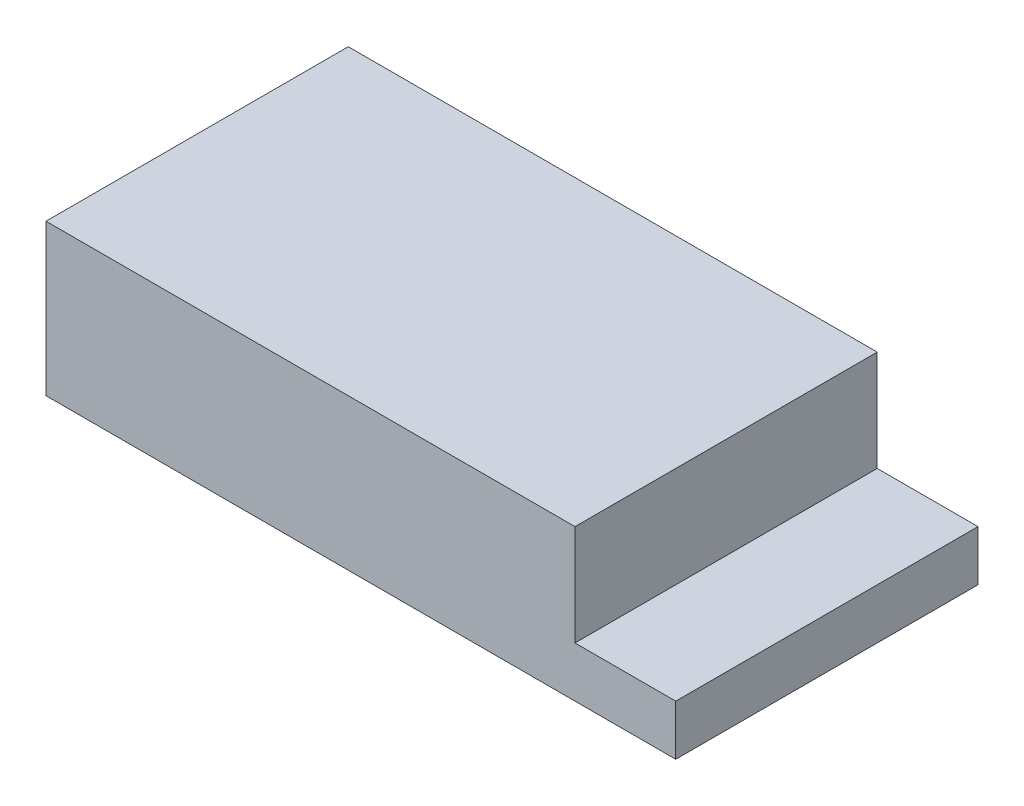
ISO-10303-21;
HEADER;
FILE_DESCRIPTION(('STEP AP214'),'2;1');
FILE_NAME('part.step','',(''),(''),'','','');
FILE_SCHEMA(('AUTOMOTIVE_DESIGN { 1 0 10303 214 1 1 1 1 }'));
ENDSEC;
DATA;
#1=APPLICATION_CONTEXT('core data for automotive mechanical design processes');
#2=APPLICATION_PROTOCOL_DEFINITION('international standard','automotive_design',2000,#1);
#3=PRODUCT_CONTEXT('',#1,'mechanical');
#4=PRODUCT('Part','Part','',(#3));
#5=PRODUCT_RELATED_PRODUCT_CATEGORY('part','',(#4));
#6=PRODUCT_DEFINITION_FORMATION('','',#4);
#7=PRODUCT_DEFINITION_CONTEXT('part definition',#1,'design');
#8=PRODUCT_DEFINITION('design','',#6,#7);
#9=PRODUCT_DEFINITION_SHAPE('','',#8);
#10=(LENGTH_UNIT() NAMED_UNIT(*) SI_UNIT(.MILLI.,.METRE.));
#11=(NAMED_UNIT(*) PLANE_ANGLE_UNIT() SI_UNIT($,.RADIAN.));
#12=(NAMED_UNIT(*) SI_UNIT($,.STERADIAN.) SOLID_ANGLE_UNIT());
#13=UNCERTAINTY_MEASURE_WITH_UNIT(LENGTH_MEASURE(1.E-05),#10,'distance_accuracy_value','');
#14=(GEOMETRIC_REPRESENTATION_CONTEXT(3) GLOBAL_UNCERTAINTY_ASSIGNED_CONTEXT((#13)) GLOBAL_UNIT_ASSIGNED_CONTEXT((#10,
#11,#12)) REPRESENTATION_CONTEXT('',''));
#15=CARTESIAN_POINT('',(0.,0.,0.));
#16=DIRECTION('',(0.,0.,1.));
#17=DIRECTION('',(1.,0.,0.));
#18=AXIS2_PLACEMENT_3D('',#15,#16,#17);
#19=CARTESIAN_POINT('',(125.,30.,0.));
#20=DIRECTION('',(-1.,0.,0.));
#21=DIRECTION('',(0.,0.,1.));
#22=AXIS2_PLACEMENT_3D('',#19,#20,#21);
#23=PLANE('',#22);
#24=DIRECTION('',(0.,0.,-1.));
#25=VECTOR('',#24,1.);
#26=CARTESIAN_POINT('',(125.,10.,0.));
#27=LINE('',#26,#25);
#28=CARTESIAN_POINT('',(125.,10.,0.));
#29=VERTEX_POINT('',#28);
#30=CARTESIAN_POINT('',(125.,10.,-60.));
#31=VERTEX_POINT('',#30);
#32=EDGE_CURVE('E138',#29,#31,#27,.T.);
#33=ORIENTED_EDGE('',*,*,#32,.F.);
#34=DIRECTION('',(0.,-1.,0.));
#35=VECTOR('',#34,1.);
#36=CARTESIAN_POINT('',(125.,30.,0.));
#37=LINE('',#36,#35);
#38=CARTESIAN_POINT('',(125.,0.,0.));
#39=VERTEX_POINT('',#38);
#40=EDGE_CURVE('E60',#29,#39,#37,.T.);
#41=ORIENTED_EDGE('',*,*,#40,.T.);
#42=DIRECTION('',(0.,0.,-1.));
#43=VECTOR('',#42,1.);
#44=CARTESIAN_POINT('',(125.,0.,0.));
#45=LINE('',#44,#43);
#46=CARTESIAN_POINT('',(125.,0.,-60.));
#47=VERTEX_POINT('',#46);
#48=EDGE_CURVE('E108',#39,#47,#45,.T.);
#49=ORIENTED_EDGE('',*,*,#48,.T.);
#50=DIRECTION('',(0.,-1.,0.));
#51=VECTOR('',#50,1.);
#52=CARTESIAN_POINT('',(125.,30.,-60.));
#53=LINE('',#52,#51);
#54=EDGE_CURVE('E101',#31,#47,#53,.T.);
#55=ORIENTED_EDGE('',*,*,#54,.F.);
#56=EDGE_LOOP('',(#33,#41,#49,#55));
#57=FACE_BOUND('',#56,.T.);
#58=ADVANCED_FACE('F51',(#57),#23,.F.);
#59=CARTESIAN_POINT('',(0.,30.,0.));
#60=DIRECTION('',(1.,0.,0.));
#61=DIRECTION('',(0.,0.,-1.));
#62=AXIS2_PLACEMENT_3D('',#59,#60,#61);
#63=PLANE('',#62);
#64=DIRECTION('',(0.,0.,1.));
#65=VECTOR('',#64,1.);
#66=CARTESIAN_POINT('',(0.,0.,0.));
#67=LINE('',#66,#65);
#68=CARTESIAN_POINT('',(0.,0.,-60.));
#69=VERTEX_POINT('',#68);
#70=CARTESIAN_POINT('',(0.,0.,0.));
#71=VERTEX_POINT('',#70);
#72=EDGE_CURVE('E113',#69,#71,#67,.T.);
#73=ORIENTED_EDGE('',*,*,#72,.T.);
#74=DIRECTION('',(0.,-1.,0.));
#75=VECTOR('',#74,1.);
#76=CARTESIAN_POINT('',(0.,30.,0.));
#77=LINE('',#76,#75);
#78=CARTESIAN_POINT('',(0.,30.,0.));
#79=VERTEX_POINT('',#78);
#80=EDGE_CURVE('E11',#79,#71,#77,.T.);
#81=ORIENTED_EDGE('',*,*,#80,.F.);
#82=DIRECTION('',(0.,0.,1.));
#83=VECTOR('',#82,1.);
#84=CARTESIAN_POINT('',(0.,30.,0.));
#85=LINE('',#84,#83);
#86=CARTESIAN_POINT('',(0.,30.,-60.));
#87=VERTEX_POINT('',#86);
#88=EDGE_CURVE('E107',#87,#79,#85,.T.);
#89=ORIENTED_EDGE('',*,*,#88,.F.);
#90=DIRECTION('',(0.,-1.,0.));
#91=VECTOR('',#90,1.);
#92=CARTESIAN_POINT('',(0.,30.,-60.));
#93=LINE('',#92,#91);
#94=EDGE_CURVE('E97',#87,#69,#93,.T.);
#95=ORIENTED_EDGE('',*,*,#94,.T.);
#96=EDGE_LOOP('',(#73,#81,#89,#95));
#97=FACE_BOUND('',#96,.T.);
#98=ADVANCED_FACE('F53',(#97),#63,.F.);
#99=CARTESIAN_POINT('',(0.,30.,0.));
#100=DIRECTION('',(0.,0.,-1.));
#101=DIRECTION('',(-1.,0.,0.));
#102=AXIS2_PLACEMENT_3D('',#99,#100,#101);
#103=PLANE('',#102);
#104=DIRECTION('',(1.,0.,0.));
#105=VECTOR('',#104,1.);
#106=CARTESIAN_POINT('',(125.,10.,0.));
#107=LINE('',#106,#105);
#108=CARTESIAN_POINT('',(105.,10.,0.));
#109=VERTEX_POINT('',#108);
#110=EDGE_CURVE('E152',#109,#29,#107,.T.);
#111=ORIENTED_EDGE('',*,*,#110,.F.);
#112=DIRECTION('',(0.,1.,0.));
#113=VECTOR('',#112,1.);
#114=CARTESIAN_POINT('',(105.,10.,0.));
#115=LINE('',#114,#113);
#116=CARTESIAN_POINT('',(105.,30.,0.));
#117=VERTEX_POINT('',#116);
#118=EDGE_CURVE('E120',#109,#117,#115,.T.);
#119=ORIENTED_EDGE('',*,*,#118,.T.);
#120=DIRECTION('',(1.,0.,0.));
#121=VECTOR('',#120,1.);
#122=CARTESIAN_POINT('',(0.,30.,0.));
#123=LINE('',#122,#121);
#124=EDGE_CURVE('E143',#79,#117,#123,.T.);
#125=ORIENTED_EDGE('',*,*,#124,.F.);
#126=ORIENTED_EDGE('',*,*,#80,.T.);
#127=DIRECTION('',(1.,0.,0.));
#128=VECTOR('',#127,1.);
#129=CARTESIAN_POINT('',(0.,0.,0.));
#130=LINE('',#129,#128);
#131=EDGE_CURVE('E118',#71,#39,#130,.T.);
#132=ORIENTED_EDGE('',*,*,#131,.T.);
#133=ORIENTED_EDGE('',*,*,#40,.F.);
#134=EDGE_LOOP('',(#111,#119,#125,#126,#132,#133));
#135=FACE_BOUND('',#134,.T.);
#136=ADVANCED_FACE('F141',(#135),#103,.F.);
#137=CARTESIAN_POINT('',(0.,30.,-60.));
#138=DIRECTION('',(0.,0.,1.));
#139=DIRECTION('',(1.,0.,0.));
#140=AXIS2_PLACEMENT_3D('',#137,#138,#139);
#141=PLANE('',#140);
#142=DIRECTION('',(-1.,0.,0.));
#143=VECTOR('',#142,1.);
#144=CARTESIAN_POINT('',(0.,30.,-60.));
#145=LINE('',#144,#143);
#146=CARTESIAN_POINT('',(105.,30.,-60.));
#147=VERTEX_POINT('',#146);
#148=EDGE_CURVE('E75',#147,#87,#145,.T.);
#149=ORIENTED_EDGE('',*,*,#148,.F.);
#150=DIRECTION('',(0.,1.,0.));
#151=VECTOR('',#150,1.);
#152=CARTESIAN_POINT('',(105.,10.,-60.));
#153=LINE('',#152,#151);
#154=CARTESIAN_POINT('',(105.,10.,-60.));
#155=VERTEX_POINT('',#154);
#156=EDGE_CURVE('E67',#155,#147,#153,.T.);
#157=ORIENTED_EDGE('',*,*,#156,.F.);
#158=DIRECTION('',(-1.,0.,0.));
#159=VECTOR('',#158,1.);
#160=CARTESIAN_POINT('',(125.,10.,-60.));
#161=LINE('',#160,#159);
#162=EDGE_CURVE('E164',#31,#155,#161,.T.);
#163=ORIENTED_EDGE('',*,*,#162,.F.);
#164=ORIENTED_EDGE('',*,*,#54,.T.);
#165=DIRECTION('',(-1.,0.,0.));
#166=VECTOR('',#165,1.);
#167=CARTESIAN_POINT('',(0.,0.,-60.));
#168=LINE('',#167,#166);
#169=EDGE_CURVE('E94',#47,#69,#168,.T.);
#170=ORIENTED_EDGE('',*,*,#169,.T.);
#171=ORIENTED_EDGE('',*,*,#94,.F.);
#172=EDGE_LOOP('',(#149,#157,#163,#164,#170,#171));
#173=FACE_BOUND('',#172,.T.);
#174=ADVANCED_FACE('F96',(#173),#141,.F.);
#175=CARTESIAN_POINT('',(0.,30.,0.));
#176=DIRECTION('',(0.,-1.,0.));
#177=DIRECTION('',(0.,0.,-1.));
#178=AXIS2_PLACEMENT_3D('',#175,#176,#177);
#179=PLANE('',#178);
#180=ORIENTED_EDGE('',*,*,#124,.T.);
#181=DIRECTION('',(0.,0.,1.));
#182=VECTOR('',#181,1.);
#183=CARTESIAN_POINT('',(105.,30.,0.));
#184=LINE('',#183,#182);
#185=EDGE_CURVE('E154',#147,#117,#184,.T.);
#186=ORIENTED_EDGE('',*,*,#185,.F.);
#187=ORIENTED_EDGE('',*,*,#148,.T.);
#188=ORIENTED_EDGE('',*,*,#88,.T.);
#189=EDGE_LOOP('',(#180,#186,#187,#188));
#190=FACE_BOUND('',#189,.T.);
#191=ADVANCED_FACE('F147',(#190),#179,.F.);
#192=CARTESIAN_POINT('',(0.,0.,0.));
#193=DIRECTION('',(0.,-1.,0.));
#194=DIRECTION('',(0.,0.,-1.));
#195=AXIS2_PLACEMENT_3D('',#192,#193,#194);
#196=PLANE('',#195);
#197=ORIENTED_EDGE('',*,*,#72,.F.);
#198=ORIENTED_EDGE('',*,*,#169,.F.);
#199=ORIENTED_EDGE('',*,*,#48,.F.);
#200=ORIENTED_EDGE('',*,*,#131,.F.);
#201=EDGE_LOOP('',(#197,#198,#199,#200));
#202=FACE_BOUND('',#201,.T.);
#203=ADVANCED_FACE('F116',(#202),#196,.T.);
#204=CARTESIAN_POINT('',(105.,10.,0.));
#205=DIRECTION('',(-1.,0.,0.));
#206=DIRECTION('',(0.,0.,1.));
#207=AXIS2_PLACEMENT_3D('',#204,#205,#206);
#208=PLANE('',#207);
#209=ORIENTED_EDGE('',*,*,#185,.T.);
#210=ORIENTED_EDGE('',*,*,#118,.F.);
#211=DIRECTION('',(0.,0.,1.));
#212=VECTOR('',#211,1.);
#213=CARTESIAN_POINT('',(105.,10.,0.));
#214=LINE('',#213,#212);
#215=EDGE_CURVE('E160',#155,#109,#214,.T.);
#216=ORIENTED_EDGE('',*,*,#215,.F.);
#217=ORIENTED_EDGE('',*,*,#156,.T.);
#218=EDGE_LOOP('',(#209,#210,#216,#217));
#219=FACE_BOUND('',#218,.T.);
#220=ADVANCED_FACE('F178',(#219),#208,.F.);
#221=CARTESIAN_POINT('',(0.,10.,0.));
#222=DIRECTION('',(0.,1.,0.));
#223=DIRECTION('',(0.,0.,1.));
#224=AXIS2_PLACEMENT_3D('',#221,#222,#223);
#225=PLANE('',#224);
#226=ORIENTED_EDGE('',*,*,#32,.T.);
#227=ORIENTED_EDGE('',*,*,#162,.T.);
#228=ORIENTED_EDGE('',*,*,#215,.T.);
#229=ORIENTED_EDGE('',*,*,#110,.T.);
#230=EDGE_LOOP('',(#226,#227,#228,#229));
#231=FACE_BOUND('',#230,.T.);
#232=ADVANCED_FACE('F171',(#231),#225,.T.);
#233=CLOSED_SHELL('',(#58,#98,#136,#174,#191,#203,#220,#232));
#234=MANIFOLD_SOLID_BREP('B2',#233);
#235=ADVANCED_BREP_SHAPE_REPRESENTATION('',(#18,#234),#14);
#236=SHAPE_DEFINITION_REPRESENTATION(#9,#235);
ENDSEC;
END-ISO-10303-21;
